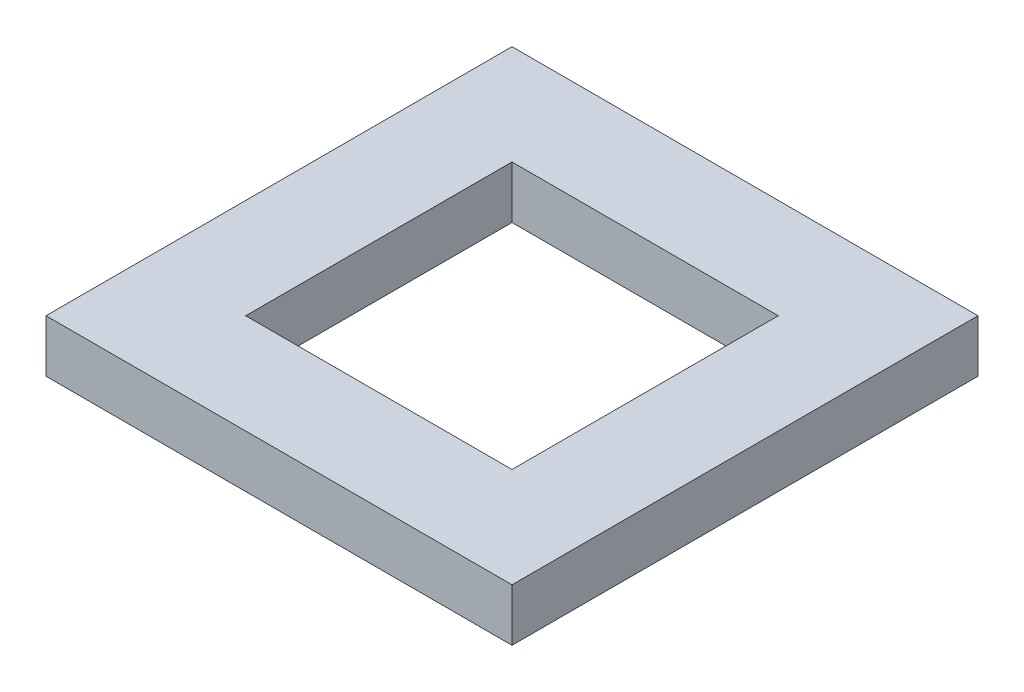
ISO-10303-21;
HEADER;
FILE_DESCRIPTION(('STEP AP214'),'2;1');
FILE_NAME('part.step','',(''),(''),'','','');
FILE_SCHEMA(('AUTOMOTIVE_DESIGN { 1 0 10303 214 1 1 1 1 }'));
ENDSEC;
DATA;
#1=APPLICATION_CONTEXT('core data for automotive mechanical design processes');
#2=APPLICATION_PROTOCOL_DEFINITION('international standard','automotive_design',2000,#1);
#3=PRODUCT_CONTEXT('',#1,'mechanical');
#4=PRODUCT('Part','Part','',(#3));
#5=PRODUCT_RELATED_PRODUCT_CATEGORY('part','',(#4));
#6=PRODUCT_DEFINITION_FORMATION('','',#4);
#7=PRODUCT_DEFINITION_CONTEXT('part definition',#1,'design');
#8=PRODUCT_DEFINITION('design','',#6,#7);
#9=PRODUCT_DEFINITION_SHAPE('','',#8);
#10=(LENGTH_UNIT() NAMED_UNIT(*) SI_UNIT(.MILLI.,.METRE.));
#11=(NAMED_UNIT(*) PLANE_ANGLE_UNIT() SI_UNIT($,.RADIAN.));
#12=(NAMED_UNIT(*) SI_UNIT($,.STERADIAN.) SOLID_ANGLE_UNIT());
#13=UNCERTAINTY_MEASURE_WITH_UNIT(LENGTH_MEASURE(1.E-05),#10,'distance_accuracy_value','');
#14=(GEOMETRIC_REPRESENTATION_CONTEXT(3) GLOBAL_UNCERTAINTY_ASSIGNED_CONTEXT((#13)) GLOBAL_UNIT_ASSIGNED_CONTEXT((#10,
#11,#12)) REPRESENTATION_CONTEXT('',''));
#15=CARTESIAN_POINT('',(0.,0.,0.));
#16=DIRECTION('',(0.,0.,1.));
#17=DIRECTION('',(1.,0.,0.));
#18=AXIS2_PLACEMENT_3D('',#15,#16,#17);
#19=CARTESIAN_POINT('',(-44.45,10.,-44.45));
#20=DIRECTION('',(1.,0.,0.));
#21=DIRECTION('',(0.,0.,-1.));
#22=AXIS2_PLACEMENT_3D('',#19,#20,#21);
#23=PLANE('',#22);
#24=DIRECTION('',(0.,0.,1.));
#25=VECTOR('',#24,1.);
#26=CARTESIAN_POINT('',(-44.45,0.,-44.45));
#27=LINE('',#26,#25);
#28=CARTESIAN_POINT('',(-44.45,0.,-44.45));
#29=VERTEX_POINT('',#28);
#30=CARTESIAN_POINT('',(-44.45,0.,44.45));
#31=VERTEX_POINT('',#30);
#32=EDGE_CURVE('E103',#29,#31,#27,.T.);
#33=ORIENTED_EDGE('',*,*,#32,.T.);
#34=DIRECTION('',(0.,-1.,0.));
#35=VECTOR('',#34,1.);
#36=CARTESIAN_POINT('',(-44.45,10.,44.45));
#37=LINE('',#36,#35);
#38=CARTESIAN_POINT('',(-44.45,10.,44.45));
#39=VERTEX_POINT('',#38);
#40=EDGE_CURVE('E11',#39,#31,#37,.T.);
#41=ORIENTED_EDGE('',*,*,#40,.F.);
#42=DIRECTION('',(0.,0.,1.));
#43=VECTOR('',#42,1.);
#44=CARTESIAN_POINT('',(-44.45,10.,-44.45));
#45=LINE('',#44,#43);
#46=CARTESIAN_POINT('',(-44.45,10.,-44.45));
#47=VERTEX_POINT('',#46);
#48=EDGE_CURVE('E132',#47,#39,#45,.T.);
#49=ORIENTED_EDGE('',*,*,#48,.F.);
#50=DIRECTION('',(0.,-1.,0.));
#51=VECTOR('',#50,1.);
#52=CARTESIAN_POINT('',(-44.45,10.,-44.45));
#53=LINE('',#52,#51);
#54=EDGE_CURVE('E142',#47,#29,#53,.T.);
#55=ORIENTED_EDGE('',*,*,#54,.T.);
#56=EDGE_LOOP('',(#33,#41,#49,#55));
#57=FACE_BOUND('',#56,.T.);
#58=ADVANCED_FACE('F33',(#57),#23,.F.);
#59=CARTESIAN_POINT('',(44.45,10.,44.45));
#60=DIRECTION('',(0.,0.,-1.));
#61=DIRECTION('',(-1.,0.,0.));
#62=AXIS2_PLACEMENT_3D('',#59,#60,#61);
#63=PLANE('',#62);
#64=DIRECTION('',(1.,0.,0.));
#65=VECTOR('',#64,1.);
#66=CARTESIAN_POINT('',(44.45,0.,44.45));
#67=LINE('',#66,#65);
#68=CARTESIAN_POINT('',(44.45,0.,44.45));
#69=VERTEX_POINT('',#68);
#70=EDGE_CURVE('E145',#31,#69,#67,.T.);
#71=ORIENTED_EDGE('',*,*,#70,.T.);
#72=DIRECTION('',(0.,-1.,0.));
#73=VECTOR('',#72,1.);
#74=CARTESIAN_POINT('',(44.45,10.,44.45));
#75=LINE('',#74,#73);
#76=CARTESIAN_POINT('',(44.45,10.,44.45));
#77=VERTEX_POINT('',#76);
#78=EDGE_CURVE('E40',#77,#69,#75,.T.);
#79=ORIENTED_EDGE('',*,*,#78,.F.);
#80=DIRECTION('',(1.,0.,0.));
#81=VECTOR('',#80,1.);
#82=CARTESIAN_POINT('',(44.45,10.,44.45));
#83=LINE('',#82,#81);
#84=EDGE_CURVE('E135',#39,#77,#83,.T.);
#85=ORIENTED_EDGE('',*,*,#84,.F.);
#86=ORIENTED_EDGE('',*,*,#40,.T.);
#87=EDGE_LOOP('',(#71,#79,#85,#86));
#88=FACE_BOUND('',#87,.T.);
#89=ADVANCED_FACE('F173',(#88),#63,.F.);
#90=CARTESIAN_POINT('',(44.45,10.,-44.45));
#91=DIRECTION('',(-1.,0.,0.));
#92=DIRECTION('',(0.,0.,1.));
#93=AXIS2_PLACEMENT_3D('',#90,#91,#92);
#94=PLANE('',#93);
#95=DIRECTION('',(0.,0.,-1.));
#96=VECTOR('',#95,1.);
#97=CARTESIAN_POINT('',(44.45,0.,-44.45));
#98=LINE('',#97,#96);
#99=CARTESIAN_POINT('',(44.45,0.,-44.45));
#100=VERTEX_POINT('',#99);
#101=EDGE_CURVE('E147',#69,#100,#98,.T.);
#102=ORIENTED_EDGE('',*,*,#101,.T.);
#103=DIRECTION('',(0.,-1.,0.));
#104=VECTOR('',#103,1.);
#105=CARTESIAN_POINT('',(44.45,10.,-44.45));
#106=LINE('',#105,#104);
#107=CARTESIAN_POINT('',(44.45,10.,-44.45));
#108=VERTEX_POINT('',#107);
#109=EDGE_CURVE('E152',#108,#100,#106,.T.);
#110=ORIENTED_EDGE('',*,*,#109,.F.);
#111=DIRECTION('',(0.,0.,-1.));
#112=VECTOR('',#111,1.);
#113=CARTESIAN_POINT('',(44.45,10.,-44.45));
#114=LINE('',#113,#112);
#115=EDGE_CURVE('E138',#77,#108,#114,.T.);
#116=ORIENTED_EDGE('',*,*,#115,.F.);
#117=ORIENTED_EDGE('',*,*,#78,.T.);
#118=EDGE_LOOP('',(#102,#110,#116,#117));
#119=FACE_BOUND('',#118,.T.);
#120=ADVANCED_FACE('F159',(#119),#94,.F.);
#121=CARTESIAN_POINT('',(44.45,10.,-44.45));
#122=DIRECTION('',(0.,0.,1.));
#123=DIRECTION('',(1.,0.,0.));
#124=AXIS2_PLACEMENT_3D('',#121,#122,#123);
#125=PLANE('',#124);
#126=DIRECTION('',(-1.,0.,0.));
#127=VECTOR('',#126,1.);
#128=CARTESIAN_POINT('',(44.45,0.,-44.45));
#129=LINE('',#128,#127);
#130=EDGE_CURVE('E136',#100,#29,#129,.T.);
#131=ORIENTED_EDGE('',*,*,#130,.T.);
#132=ORIENTED_EDGE('',*,*,#54,.F.);
#133=DIRECTION('',(-1.,0.,0.));
#134=VECTOR('',#133,1.);
#135=CARTESIAN_POINT('',(44.45,10.,-44.45));
#136=LINE('',#135,#134);
#137=EDGE_CURVE('E140',#108,#47,#136,.T.);
#138=ORIENTED_EDGE('',*,*,#137,.F.);
#139=ORIENTED_EDGE('',*,*,#109,.T.);
#140=EDGE_LOOP('',(#131,#132,#138,#139));
#141=FACE_BOUND('',#140,.T.);
#142=ADVANCED_FACE('F166',(#141),#125,.F.);
#143=CARTESIAN_POINT('',(0.,10.,0.));
#144=DIRECTION('',(0.,-1.,0.));
#145=DIRECTION('',(0.,0.,-1.));
#146=AXIS2_PLACEMENT_3D('',#143,#144,#145);
#147=PLANE('',#146);
#148=DIRECTION('',(-1.,0.,0.));
#149=VECTOR('',#148,1.);
#150=CARTESIAN_POINT('',(25.4,10.,-25.4));
#151=LINE('',#150,#149);
#152=CARTESIAN_POINT('',(25.4,10.,-25.4));
#153=VERTEX_POINT('',#152);
#154=CARTESIAN_POINT('',(-25.4,10.,-25.4));
#155=VERTEX_POINT('',#154);
#156=EDGE_CURVE('E116',#153,#155,#151,.T.);
#157=ORIENTED_EDGE('',*,*,#156,.F.);
#158=DIRECTION('',(0.,0.,-1.));
#159=VECTOR('',#158,1.);
#160=CARTESIAN_POINT('',(25.4,10.,25.4));
#161=LINE('',#160,#159);
#162=CARTESIAN_POINT('',(25.4,10.,25.4));
#163=VERTEX_POINT('',#162);
#164=EDGE_CURVE('E47',#163,#153,#161,.T.);
#165=ORIENTED_EDGE('',*,*,#164,.F.);
#166=DIRECTION('',(1.,0.,0.));
#167=VECTOR('',#166,1.);
#168=CARTESIAN_POINT('',(-25.4,10.,25.4));
#169=LINE('',#168,#167);
#170=CARTESIAN_POINT('',(-25.4,10.,25.4));
#171=VERTEX_POINT('',#170);
#172=EDGE_CURVE('E109',#171,#163,#169,.T.);
#173=ORIENTED_EDGE('',*,*,#172,.F.);
#174=DIRECTION('',(0.,0.,1.));
#175=VECTOR('',#174,1.);
#176=CARTESIAN_POINT('',(-25.4,10.,-25.4));
#177=LINE('',#176,#175);
#178=EDGE_CURVE('E123',#155,#171,#177,.T.);
#179=ORIENTED_EDGE('',*,*,#178,.F.);
#180=EDGE_LOOP('',(#157,#165,#173,#179));
#181=FACE_BOUND('',#180,.T.);
#182=ORIENTED_EDGE('',*,*,#48,.T.);
#183=ORIENTED_EDGE('',*,*,#84,.T.);
#184=ORIENTED_EDGE('',*,*,#115,.T.);
#185=ORIENTED_EDGE('',*,*,#137,.T.);
#186=EDGE_LOOP('',(#182,#183,#184,#185));
#187=FACE_BOUND('',#186,.T.);
#188=ADVANCED_FACE('F172',(#181,#187),#147,.F.);
#189=CARTESIAN_POINT('',(0.,0.,0.));
#190=DIRECTION('',(0.,-1.,0.));
#191=DIRECTION('',(0.,0.,-1.));
#192=AXIS2_PLACEMENT_3D('',#189,#190,#191);
#193=PLANE('',#192);
#194=DIRECTION('',(0.,0.,-1.));
#195=VECTOR('',#194,1.);
#196=CARTESIAN_POINT('',(25.4,0.,25.4));
#197=LINE('',#196,#195);
#198=CARTESIAN_POINT('',(25.4,0.,25.4));
#199=VERTEX_POINT('',#198);
#200=CARTESIAN_POINT('',(25.4,0.,-25.4));
#201=VERTEX_POINT('',#200);
#202=EDGE_CURVE('E107',#199,#201,#197,.T.);
#203=ORIENTED_EDGE('',*,*,#202,.T.);
#204=DIRECTION('',(-1.,0.,0.));
#205=VECTOR('',#204,1.);
#206=CARTESIAN_POINT('',(25.4,0.,-25.4));
#207=LINE('',#206,#205);
#208=CARTESIAN_POINT('',(-25.4,0.,-25.4));
#209=VERTEX_POINT('',#208);
#210=EDGE_CURVE('E96',#201,#209,#207,.T.);
#211=ORIENTED_EDGE('',*,*,#210,.T.);
#212=DIRECTION('',(0.,0.,1.));
#213=VECTOR('',#212,1.);
#214=CARTESIAN_POINT('',(-25.4,0.,-25.4));
#215=LINE('',#214,#213);
#216=CARTESIAN_POINT('',(-25.4,0.,25.4));
#217=VERTEX_POINT('',#216);
#218=EDGE_CURVE('E118',#209,#217,#215,.T.);
#219=ORIENTED_EDGE('',*,*,#218,.T.);
#220=DIRECTION('',(1.,0.,0.));
#221=VECTOR('',#220,1.);
#222=CARTESIAN_POINT('',(-25.4,0.,25.4));
#223=LINE('',#222,#221);
#224=EDGE_CURVE('E114',#217,#199,#223,.T.);
#225=ORIENTED_EDGE('',*,*,#224,.T.);
#226=EDGE_LOOP('',(#203,#211,#219,#225));
#227=FACE_BOUND('',#226,.T.);
#228=ORIENTED_EDGE('',*,*,#32,.F.);
#229=ORIENTED_EDGE('',*,*,#130,.F.);
#230=ORIENTED_EDGE('',*,*,#101,.F.);
#231=ORIENTED_EDGE('',*,*,#70,.F.);
#232=EDGE_LOOP('',(#228,#229,#230,#231));
#233=FACE_BOUND('',#232,.T.);
#234=ADVANCED_FACE('F112',(#227,#233),#193,.T.);
#235=CARTESIAN_POINT('',(25.4,-0.000999999999999265,25.4));
#236=DIRECTION('',(1.,0.,0.));
#237=DIRECTION('',(0.,0.,-1.));
#238=AXIS2_PLACEMENT_3D('',#235,#236,#237);
#239=PLANE('',#238);
#240=DIRECTION('',(0.,1.,0.));
#241=VECTOR('',#240,1.);
#242=CARTESIAN_POINT('',(25.4,-0.000999999999999265,25.4));
#243=LINE('',#242,#241);
#244=EDGE_CURVE('E104',#199,#163,#243,.T.);
#245=ORIENTED_EDGE('',*,*,#244,.T.);
#246=ORIENTED_EDGE('',*,*,#164,.T.);
#247=DIRECTION('',(0.,1.,0.));
#248=VECTOR('',#247,1.);
#249=CARTESIAN_POINT('',(25.4,-0.000999999999999265,-25.4));
#250=LINE('',#249,#248);
#251=EDGE_CURVE('E98',#201,#153,#250,.T.);
#252=ORIENTED_EDGE('',*,*,#251,.F.);
#253=ORIENTED_EDGE('',*,*,#202,.F.);
#254=EDGE_LOOP('',(#245,#246,#252,#253));
#255=FACE_BOUND('',#254,.T.);
#256=ADVANCED_FACE('F106',(#255),#239,.F.);
#257=CARTESIAN_POINT('',(-25.4,-0.000999999999999265,25.4));
#258=DIRECTION('',(0.,0.,1.));
#259=DIRECTION('',(1.,0.,0.));
#260=AXIS2_PLACEMENT_3D('',#257,#258,#259);
#261=PLANE('',#260);
#262=DIRECTION('',(0.,1.,0.));
#263=VECTOR('',#262,1.);
#264=CARTESIAN_POINT('',(-25.4,-0.000999999999999265,25.4));
#265=LINE('',#264,#263);
#266=EDGE_CURVE('E129',#217,#171,#265,.T.);
#267=ORIENTED_EDGE('',*,*,#266,.T.);
#268=ORIENTED_EDGE('',*,*,#172,.T.);
#269=ORIENTED_EDGE('',*,*,#244,.F.);
#270=ORIENTED_EDGE('',*,*,#224,.F.);
#271=EDGE_LOOP('',(#267,#268,#269,#270));
#272=FACE_BOUND('',#271,.T.);
#273=ADVANCED_FACE('F190',(#272),#261,.F.);
#274=CARTESIAN_POINT('',(-25.4,-0.000999999999999265,-25.4));
#275=DIRECTION('',(-1.,0.,0.));
#276=DIRECTION('',(0.,0.,1.));
#277=AXIS2_PLACEMENT_3D('',#274,#275,#276);
#278=PLANE('',#277);
#279=DIRECTION('',(0.,1.,0.));
#280=VECTOR('',#279,1.);
#281=CARTESIAN_POINT('',(-25.4,-0.000999999999999265,-25.4));
#282=LINE('',#281,#280);
#283=EDGE_CURVE('E55',#209,#155,#282,.T.);
#284=ORIENTED_EDGE('',*,*,#283,.T.);
#285=ORIENTED_EDGE('',*,*,#178,.T.);
#286=ORIENTED_EDGE('',*,*,#266,.F.);
#287=ORIENTED_EDGE('',*,*,#218,.F.);
#288=EDGE_LOOP('',(#284,#285,#286,#287));
#289=FACE_BOUND('',#288,.T.);
#290=ADVANCED_FACE('F193',(#289),#278,.F.);
#291=CARTESIAN_POINT('',(25.4,-0.000999999999999265,-25.4));
#292=DIRECTION('',(0.,0.,-1.));
#293=DIRECTION('',(-1.,0.,0.));
#294=AXIS2_PLACEMENT_3D('',#291,#292,#293);
#295=PLANE('',#294);
#296=ORIENTED_EDGE('',*,*,#251,.T.);
#297=ORIENTED_EDGE('',*,*,#156,.T.);
#298=ORIENTED_EDGE('',*,*,#283,.F.);
#299=ORIENTED_EDGE('',*,*,#210,.F.);
#300=EDGE_LOOP('',(#296,#297,#298,#299));
#301=FACE_BOUND('',#300,.T.);
#302=ADVANCED_FACE('F97',(#301),#295,.F.);
#303=CLOSED_SHELL('',(#58,#89,#120,#142,#188,#234,#256,#273,#290,#302));
#304=MANIFOLD_SOLID_BREP('B2',#303);
#305=ADVANCED_BREP_SHAPE_REPRESENTATION('',(#18,#304),#14);
#306=SHAPE_DEFINITION_REPRESENTATION(#9,#305);
ENDSEC;
END-ISO-10303-21;
